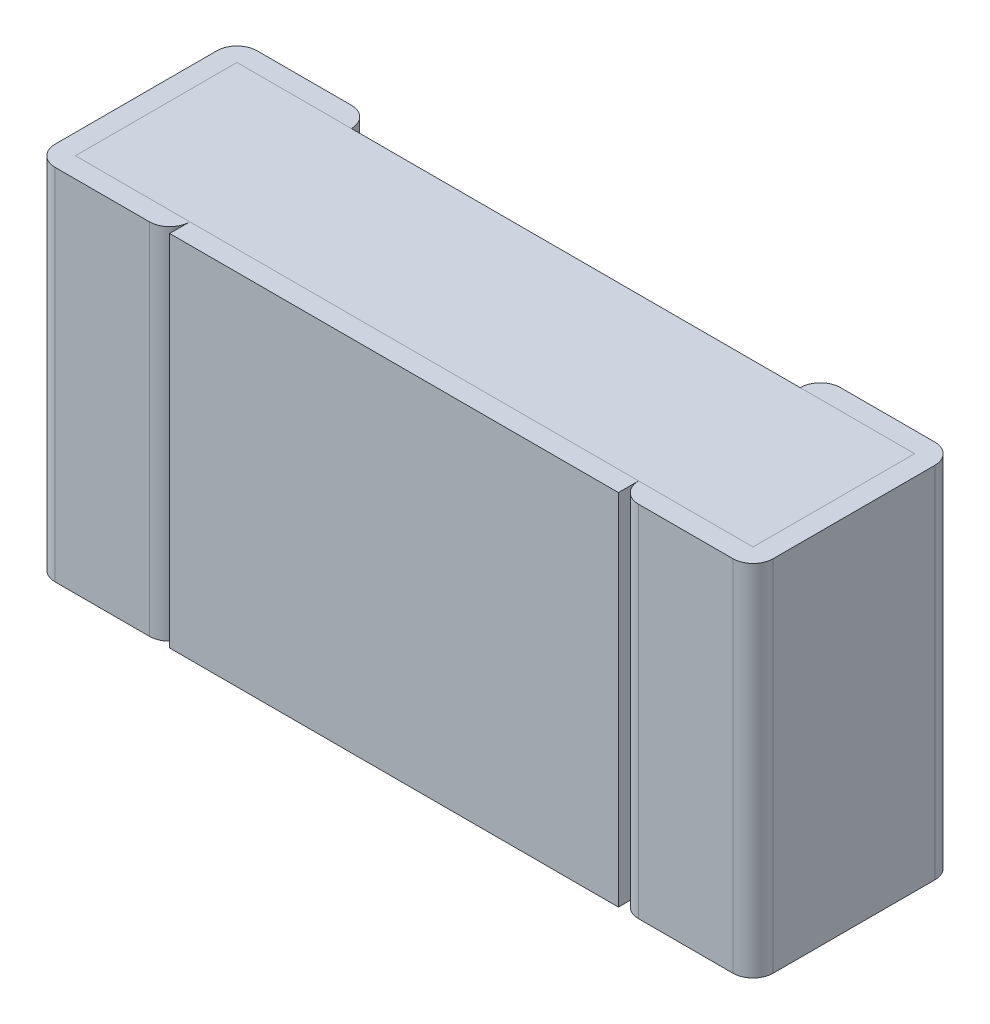
ISO-10303-21;
HEADER;
FILE_DESCRIPTION(('STEP AP214'),'2;1');
FILE_NAME('part.step','',(''),(''),'','','');
FILE_SCHEMA(('AUTOMOTIVE_DESIGN { 1 0 10303 214 1 1 1 1 }'));
ENDSEC;
DATA;
#1=APPLICATION_CONTEXT('core data for automotive mechanical design processes');
#2=APPLICATION_PROTOCOL_DEFINITION('international standard','automotive_design',2000,#1);
#3=PRODUCT_CONTEXT('',#1,'mechanical');
#4=PRODUCT('Part','Part','',(#3));
#5=PRODUCT_RELATED_PRODUCT_CATEGORY('part','',(#4));
#6=PRODUCT_DEFINITION_FORMATION('','',#4);
#7=PRODUCT_DEFINITION_CONTEXT('part definition',#1,'design');
#8=PRODUCT_DEFINITION('design','',#6,#7);
#9=PRODUCT_DEFINITION_SHAPE('','',#8);
#10=(LENGTH_UNIT() NAMED_UNIT(*) SI_UNIT(.MILLI.,.METRE.));
#11=(NAMED_UNIT(*) PLANE_ANGLE_UNIT() SI_UNIT($,.RADIAN.));
#12=(NAMED_UNIT(*) SI_UNIT($,.STERADIAN.) SOLID_ANGLE_UNIT());
#13=UNCERTAINTY_MEASURE_WITH_UNIT(LENGTH_MEASURE(1.E-05),#10,'distance_accuracy_value','');
#14=(GEOMETRIC_REPRESENTATION_CONTEXT(3) GLOBAL_UNCERTAINTY_ASSIGNED_CONTEXT((#13)) GLOBAL_UNIT_ASSIGNED_CONTEXT((#10,
#11,#12)) REPRESENTATION_CONTEXT('',''));
#15=CARTESIAN_POINT('',(0.,0.,0.));
#16=DIRECTION('',(0.,0.,1.));
#17=DIRECTION('',(1.,0.,0.));
#18=AXIS2_PLACEMENT_3D('',#15,#16,#17);
#19=CARTESIAN_POINT('',(194.804744279938,93.2580432923502,112.661582908599));
#20=DIRECTION('',(0.,0.,1.));
#21=DIRECTION('',(1.,0.,0.));
#22=AXIS2_PLACEMENT_3D('',#19,#20,#21);
#23=PLANE('',#22);
#24=DIRECTION('',(0.,1.,0.));
#25=VECTOR('',#24,1.);
#26=CARTESIAN_POINT('',(194.804744279938,93.2580432923502,112.661582908599));
#27=LINE('',#26,#25);
#28=CARTESIAN_POINT('',(194.804744279938,93.2580432923502,112.661582908599));
#29=VERTEX_POINT('',#28);
#30=CARTESIAN_POINT('',(194.804744279938,94.0580432923502,112.661582908599));
#31=VERTEX_POINT('',#30);
#32=EDGE_CURVE('E67',#29,#31,#27,.T.);
#33=ORIENTED_EDGE('',*,*,#32,.F.);
#34=DIRECTION('',(1.,0.,0.));
#35=VECTOR('',#34,1.);
#36=CARTESIAN_POINT('',(194.804744279938,93.2580432923502,112.661582908599));
#37=LINE('',#36,#35);
#38=CARTESIAN_POINT('',(195.804744279938,93.2580432923502,112.661582908599));
#39=VERTEX_POINT('',#38);
#40=EDGE_CURVE('E11',#29,#39,#37,.T.);
#41=ORIENTED_EDGE('',*,*,#40,.T.);
#42=DIRECTION('',(0.,1.,0.));
#43=VECTOR('',#42,1.);
#44=CARTESIAN_POINT('',(195.804744279938,93.2580432923502,112.661582908599));
#45=LINE('',#44,#43);
#46=CARTESIAN_POINT('',(195.804744279938,94.0580432923502,112.661582908599));
#47=VERTEX_POINT('',#46);
#48=EDGE_CURVE('E55',#39,#47,#45,.T.);
#49=ORIENTED_EDGE('',*,*,#48,.T.);
#50=DIRECTION('',(1.,0.,0.));
#51=VECTOR('',#50,1.);
#52=CARTESIAN_POINT('',(194.804744279938,94.0580432923502,112.661582908599));
#53=LINE('',#52,#51);
#54=EDGE_CURVE('E454',#31,#47,#53,.T.);
#55=ORIENTED_EDGE('',*,*,#54,.F.);
#56=EDGE_LOOP('',(#33,#41,#49,#55));
#57=FACE_BOUND('',#56,.T.);
#58=ADVANCED_FACE('F44',(#57),#23,.T.);
#59=CARTESIAN_POINT('',(195.804744279938,93.2580432923502,112.616582908599));
#60=DIRECTION('',(1.,0.,0.));
#61=DIRECTION('',(0.,1.,0.));
#62=AXIS2_PLACEMENT_3D('',#59,#60,#61);
#63=PLANE('',#62);
#64=DIRECTION('',(0.,0.,1.));
#65=VECTOR('',#64,1.);
#66=CARTESIAN_POINT('',(195.804744279938,93.2580432923502,112.616582908599));
#67=LINE('',#66,#65);
#68=CARTESIAN_POINT('',(195.804744279938,93.2580432923502,112.616582908599));
#69=VERTEX_POINT('',#68);
#70=EDGE_CURVE('E331',#69,#39,#67,.T.);
#71=ORIENTED_EDGE('',*,*,#70,.F.);
#72=DIRECTION('',(0.,1.,0.));
#73=VECTOR('',#72,1.);
#74=CARTESIAN_POINT('',(195.804744279938,93.2580432923502,112.616582908599));
#75=LINE('',#74,#73);
#76=CARTESIAN_POINT('',(195.804744279938,94.0580432923502,112.616582908599));
#77=VERTEX_POINT('',#76);
#78=EDGE_CURVE('E388',#69,#77,#75,.T.);
#79=ORIENTED_EDGE('',*,*,#78,.T.);
#80=DIRECTION('',(0.,0.,1.));
#81=VECTOR('',#80,1.);
#82=CARTESIAN_POINT('',(195.804744279938,94.0580432923502,112.616582908599));
#83=LINE('',#82,#81);
#84=EDGE_CURVE('E434',#77,#47,#83,.T.);
#85=ORIENTED_EDGE('',*,*,#84,.T.);
#86=ORIENTED_EDGE('',*,*,#48,.F.);
#87=EDGE_LOOP('',(#71,#79,#85,#86));
#88=FACE_BOUND('',#87,.T.);
#89=ADVANCED_FACE('F46',(#88),#63,.T.);
#90=CARTESIAN_POINT('',(195.849744279938,93.2580432923502,112.616582908599));
#91=DIRECTION('',(0.,1.,0.));
#92=DIRECTION('',(-1.,0.,0.));
#93=AXIS2_PLACEMENT_3D('',#90,#91,#92);
#94=CYLINDRICAL_SURFACE('',#93,0.0449999999999895);
#95=CARTESIAN_POINT('',(195.849744279938,93.2580432923502,112.616582908599));
#96=DIRECTION('',(0.,1.,0.));
#97=DIRECTION('',(0.,0.,1.));
#98=AXIS2_PLACEMENT_3D('',#95,#96,#97);
#99=CIRCLE('',#98,0.0450000000000034);
#100=CARTESIAN_POINT('',(195.849744279938,93.2580432923502,112.661582908599));
#101=VERTEX_POINT('',#100);
#102=EDGE_CURVE('E380',#69,#101,#99,.T.);
#103=ORIENTED_EDGE('',*,*,#102,.T.);
#104=DIRECTION('',(0.,1.,0.));
#105=VECTOR('',#104,1.);
#106=CARTESIAN_POINT('',(195.849744279938,93.2580432923502,112.661582908599));
#107=LINE('',#106,#105);
#108=CARTESIAN_POINT('',(195.849744279938,94.0580432923502,112.661582908599));
#109=VERTEX_POINT('',#108);
#110=EDGE_CURVE('E376',#101,#109,#107,.T.);
#111=ORIENTED_EDGE('',*,*,#110,.T.);
#112=CARTESIAN_POINT('',(195.849744279938,94.0580432923502,112.616582908599));
#113=DIRECTION('',(0.,1.,0.));
#114=DIRECTION('',(0.,0.,1.));
#115=AXIS2_PLACEMENT_3D('',#112,#113,#114);
#116=CIRCLE('',#115,0.0450000000000034);
#117=EDGE_CURVE('E297',#77,#109,#116,.T.);
#118=ORIENTED_EDGE('',*,*,#117,.F.);
#119=ORIENTED_EDGE('',*,*,#78,.F.);
#120=EDGE_LOOP('',(#103,#111,#118,#119));
#121=FACE_BOUND('',#120,.T.);
#122=ADVANCED_FACE('F537',(#121),#94,.T.);
#123=CARTESIAN_POINT('',(195.804744279938,93.2580432923502,112.661582908599));
#124=DIRECTION('',(0.,0.,1.));
#125=DIRECTION('',(1.,0.,0.));
#126=AXIS2_PLACEMENT_3D('',#123,#124,#125);
#127=PLANE('',#126);
#128=DIRECTION('',(1.,0.,0.));
#129=VECTOR('',#128,1.);
#130=CARTESIAN_POINT('',(195.804744279938,94.0580432923502,112.661582908599));
#131=LINE('',#130,#129);
#132=CARTESIAN_POINT('',(196.059744279938,94.0580432923502,112.661582908599));
#133=VERTEX_POINT('',#132);
#134=EDGE_CURVE('E372',#109,#133,#131,.T.);
#135=ORIENTED_EDGE('',*,*,#134,.F.);
#136=ORIENTED_EDGE('',*,*,#110,.F.);
#137=DIRECTION('',(1.,0.,0.));
#138=VECTOR('',#137,1.);
#139=CARTESIAN_POINT('',(195.804744279938,93.2580432923502,112.661582908599));
#140=LINE('',#139,#138);
#141=CARTESIAN_POINT('',(196.059744279938,93.2580432923502,112.661582908599));
#142=VERTEX_POINT('',#141);
#143=EDGE_CURVE('E381',#101,#142,#140,.T.);
#144=ORIENTED_EDGE('',*,*,#143,.T.);
#145=DIRECTION('',(0.,1.,0.));
#146=VECTOR('',#145,1.);
#147=CARTESIAN_POINT('',(196.059744279938,93.2580432923502,112.661582908599));
#148=LINE('',#147,#146);
#149=EDGE_CURVE('E423',#142,#133,#148,.T.);
#150=ORIENTED_EDGE('',*,*,#149,.T.);
#151=EDGE_LOOP('',(#135,#136,#144,#150));
#152=FACE_BOUND('',#151,.T.);
#153=ADVANCED_FACE('F533',(#152),#127,.T.);
#154=CARTESIAN_POINT('',(196.059744279938,93.2580432923502,112.616582908599));
#155=DIRECTION('',(0.,1.,0.));
#156=DIRECTION('',(1.,0.,0.));
#157=AXIS2_PLACEMENT_3D('',#154,#155,#156);
#158=CYLINDRICAL_SURFACE('',#157,0.0449999999999895);
#159=DIRECTION('',(0.,1.,0.));
#160=VECTOR('',#159,1.);
#161=CARTESIAN_POINT('',(196.104744279938,93.2580432923502,112.616582908599));
#162=LINE('',#161,#160);
#163=CARTESIAN_POINT('',(196.104744279938,93.2580432923502,112.616582908599));
#164=VERTEX_POINT('',#163);
#165=CARTESIAN_POINT('',(196.104744279938,94.0580432923502,112.616582908599));
#166=VERTEX_POINT('',#165);
#167=EDGE_CURVE('E419',#164,#166,#162,.T.);
#168=ORIENTED_EDGE('',*,*,#167,.T.);
#169=CARTESIAN_POINT('',(196.059744279938,94.0580432923502,112.616582908599));
#170=DIRECTION('',(0.,-1.,0.));
#171=DIRECTION('',(0.,0.,1.));
#172=AXIS2_PLACEMENT_3D('',#169,#170,#171);
#173=CIRCLE('',#172,0.0450000000000034);
#174=EDGE_CURVE('E424',#166,#133,#173,.T.);
#175=ORIENTED_EDGE('',*,*,#174,.T.);
#176=ORIENTED_EDGE('',*,*,#149,.F.);
#177=CARTESIAN_POINT('',(196.059744279938,93.2580432923502,112.616582908599));
#178=DIRECTION('',(0.,-1.,0.));
#179=DIRECTION('',(0.,0.,1.));
#180=AXIS2_PLACEMENT_3D('',#177,#178,#179);
#181=CIRCLE('',#180,0.0450000000000034);
#182=EDGE_CURVE('E363',#164,#142,#181,.T.);
#183=ORIENTED_EDGE('',*,*,#182,.F.);
#184=EDGE_LOOP('',(#168,#175,#176,#183));
#185=FACE_BOUND('',#184,.T.);
#186=ADVANCED_FACE('F511',(#185),#158,.T.);
#187=CARTESIAN_POINT('',(196.104744279938,93.2580432923502,112.211582908599));
#188=DIRECTION('',(1.,0.,0.));
#189=DIRECTION('',(0.,1.,0.));
#190=AXIS2_PLACEMENT_3D('',#187,#188,#189);
#191=PLANE('',#190);
#192=DIRECTION('',(0.,0.,1.));
#193=VECTOR('',#192,1.);
#194=CARTESIAN_POINT('',(196.104744279938,93.2580432923502,112.211582908599));
#195=LINE('',#194,#193);
#196=CARTESIAN_POINT('',(196.104744279938,93.2580432923502,112.256582908599));
#197=VERTEX_POINT('',#196);
#198=EDGE_CURVE('E332',#197,#164,#195,.T.);
#199=ORIENTED_EDGE('',*,*,#198,.F.);
#200=DIRECTION('',(0.,1.,0.));
#201=VECTOR('',#200,1.);
#202=CARTESIAN_POINT('',(196.104744279938,93.2580432923502,112.256582908599));
#203=LINE('',#202,#201);
#204=CARTESIAN_POINT('',(196.104744279938,94.0580432923502,112.256582908599));
#205=VERTEX_POINT('',#204);
#206=EDGE_CURVE('E428',#197,#205,#203,.T.);
#207=ORIENTED_EDGE('',*,*,#206,.T.);
#208=DIRECTION('',(0.,0.,1.));
#209=VECTOR('',#208,1.);
#210=CARTESIAN_POINT('',(196.104744279938,94.0580432923502,112.211582908599));
#211=LINE('',#210,#209);
#212=EDGE_CURVE('E291',#205,#166,#211,.T.);
#213=ORIENTED_EDGE('',*,*,#212,.T.);
#214=ORIENTED_EDGE('',*,*,#167,.F.);
#215=EDGE_LOOP('',(#199,#207,#213,#214));
#216=FACE_BOUND('',#215,.T.);
#217=ADVANCED_FACE('F505',(#216),#191,.T.);
#218=CARTESIAN_POINT('',(196.059744279938,93.2580432923502,112.256582908599));
#219=DIRECTION('',(0.,1.,0.));
#220=DIRECTION('',(1.,0.,0.));
#221=AXIS2_PLACEMENT_3D('',#218,#219,#220);
#222=CYLINDRICAL_SURFACE('',#221,0.0449999999999895);
#223=CARTESIAN_POINT('',(196.059744279938,93.2580432923502,112.256582908599));
#224=DIRECTION('',(0.,1.,0.));
#225=DIRECTION('',(0.,0.,1.));
#226=AXIS2_PLACEMENT_3D('',#223,#224,#225);
#227=CIRCLE('',#226,0.0450000000000034);
#228=CARTESIAN_POINT('',(196.059744279938,93.2580432923502,112.211582908599));
#229=VERTEX_POINT('',#228);
#230=EDGE_CURVE('E317',#197,#229,#227,.T.);
#231=ORIENTED_EDGE('',*,*,#230,.T.);
#232=DIRECTION('',(0.,1.,0.));
#233=VECTOR('',#232,1.);
#234=CARTESIAN_POINT('',(196.059744279938,93.2580432923502,112.211582908599));
#235=LINE('',#234,#233);
#236=CARTESIAN_POINT('',(196.059744279938,94.0580432923502,112.211582908599));
#237=VERTEX_POINT('',#236);
#238=EDGE_CURVE('E313',#229,#237,#235,.T.);
#239=ORIENTED_EDGE('',*,*,#238,.T.);
#240=CARTESIAN_POINT('',(196.059744279938,94.0580432923502,112.256582908599));
#241=DIRECTION('',(0.,1.,0.));
#242=DIRECTION('',(0.,0.,1.));
#243=AXIS2_PLACEMENT_3D('',#240,#241,#242);
#244=CIRCLE('',#243,0.0450000000000034);
#245=EDGE_CURVE('E352',#205,#237,#244,.T.);
#246=ORIENTED_EDGE('',*,*,#245,.F.);
#247=ORIENTED_EDGE('',*,*,#206,.F.);
#248=EDGE_LOOP('',(#231,#239,#246,#247));
#249=FACE_BOUND('',#248,.T.);
#250=ADVANCED_FACE('F606',(#249),#222,.T.);
#251=CARTESIAN_POINT('',(195.804744279938,93.2580432923502,112.211582908599));
#252=DIRECTION('',(0.,0.,1.));
#253=DIRECTION('',(1.,0.,0.));
#254=AXIS2_PLACEMENT_3D('',#251,#252,#253);
#255=PLANE('',#254);
#256=ORIENTED_EDGE('',*,*,#238,.F.);
#257=DIRECTION('',(1.,0.,0.));
#258=VECTOR('',#257,1.);
#259=CARTESIAN_POINT('',(195.804744279938,93.2580432923502,112.211582908599));
#260=LINE('',#259,#258);
#261=CARTESIAN_POINT('',(195.849744279938,93.2580432923502,112.211582908599));
#262=VERTEX_POINT('',#261);
#263=EDGE_CURVE('E301',#262,#229,#260,.T.);
#264=ORIENTED_EDGE('',*,*,#263,.F.);
#265=DIRECTION('',(0.,1.,0.));
#266=VECTOR('',#265,1.);
#267=CARTESIAN_POINT('',(195.849744279938,93.2580432923502,112.211582908599));
#268=LINE('',#267,#266);
#269=CARTESIAN_POINT('',(195.849744279938,94.0580432923502,112.211582908599));
#270=VERTEX_POINT('',#269);
#271=EDGE_CURVE('E318',#262,#270,#268,.T.);
#272=ORIENTED_EDGE('',*,*,#271,.T.);
#273=DIRECTION('',(1.,0.,0.));
#274=VECTOR('',#273,1.);
#275=CARTESIAN_POINT('',(195.804744279938,94.0580432923502,112.211582908599));
#276=LINE('',#275,#274);
#277=EDGE_CURVE('E364',#270,#237,#276,.T.);
#278=ORIENTED_EDGE('',*,*,#277,.T.);
#279=EDGE_LOOP('',(#256,#264,#272,#278));
#280=FACE_BOUND('',#279,.T.);
#281=ADVANCED_FACE('F602',(#280),#255,.F.);
#282=CARTESIAN_POINT('',(195.849744279938,93.2580432923502,112.256582908599));
#283=DIRECTION('',(0.,1.,0.));
#284=DIRECTION('',(-1.,0.,0.));
#285=AXIS2_PLACEMENT_3D('',#282,#283,#284);
#286=CYLINDRICAL_SURFACE('',#285,0.0449999999999895);
#287=DIRECTION('',(0.,1.,0.));
#288=VECTOR('',#287,1.);
#289=CARTESIAN_POINT('',(195.804744279938,93.2580432923502,112.256582908599));
#290=LINE('',#289,#288);
#291=CARTESIAN_POINT('',(195.804744279938,93.2580432923502,112.256582908599));
#292=VERTEX_POINT('',#291);
#293=CARTESIAN_POINT('',(195.804744279938,94.0580432923502,112.256582908599));
#294=VERTEX_POINT('',#293);
#295=EDGE_CURVE('E368',#292,#294,#290,.T.);
#296=ORIENTED_EDGE('',*,*,#295,.T.);
#297=CARTESIAN_POINT('',(195.849744279938,94.0580432923502,112.256582908599));
#298=DIRECTION('',(0.,-1.,0.));
#299=DIRECTION('',(0.,0.,1.));
#300=AXIS2_PLACEMENT_3D('',#297,#298,#299);
#301=CIRCLE('',#300,0.0450000000000034);
#302=EDGE_CURVE('E392',#294,#270,#301,.T.);
#303=ORIENTED_EDGE('',*,*,#302,.T.);
#304=ORIENTED_EDGE('',*,*,#271,.F.);
#305=CARTESIAN_POINT('',(195.849744279938,93.2580432923502,112.256582908599));
#306=DIRECTION('',(0.,-1.,0.));
#307=DIRECTION('',(0.,0.,1.));
#308=AXIS2_PLACEMENT_3D('',#305,#306,#307);
#309=CIRCLE('',#308,0.0450000000000034);
#310=EDGE_CURVE('E298',#292,#262,#309,.T.);
#311=ORIENTED_EDGE('',*,*,#310,.F.);
#312=EDGE_LOOP('',(#296,#303,#304,#311));
#313=FACE_BOUND('',#312,.T.);
#314=ADVANCED_FACE('F605',(#313),#286,.T.);
#315=CARTESIAN_POINT('',(194.804744279938,94.0580432923502,112.616582908599));
#316=DIRECTION('',(0.,1.,0.));
#317=DIRECTION('',(1.,0.,0.));
#318=AXIS2_PLACEMENT_3D('',#315,#316,#317);
#319=PLANE('',#318);
#320=DIRECTION('',(1.,0.,0.));
#321=VECTOR('',#320,1.);
#322=CARTESIAN_POINT('',(194.804744279938,94.0580432923502,112.616582908599));
#323=LINE('',#322,#321);
#324=CARTESIAN_POINT('',(194.804744279938,94.0580432923502,112.616582908599));
#325=VERTEX_POINT('',#324);
#326=EDGE_CURVE('E323',#325,#77,#323,.T.);
#327=ORIENTED_EDGE('',*,*,#326,.F.);
#328=DIRECTION('',(0.,0.,1.));
#329=VECTOR('',#328,1.);
#330=CARTESIAN_POINT('',(194.804744279938,94.0580432923502,112.616582908599));
#331=LINE('',#330,#329);
#332=EDGE_CURVE('E398',#325,#31,#331,.T.);
#333=ORIENTED_EDGE('',*,*,#332,.T.);
#334=ORIENTED_EDGE('',*,*,#54,.T.);
#335=ORIENTED_EDGE('',*,*,#84,.F.);
#336=EDGE_LOOP('',(#327,#333,#334,#335));
#337=FACE_BOUND('',#336,.T.);
#338=ADVANCED_FACE('F552',(#337),#319,.T.);
#339=CARTESIAN_POINT('',(195.804744279938,94.0580432923502,112.211582908599));
#340=DIRECTION('',(0.,1.,0.));
#341=DIRECTION('',(1.,0.,0.));
#342=AXIS2_PLACEMENT_3D('',#339,#340,#341);
#343=PLANE('',#342);
#344=ORIENTED_EDGE('',*,*,#277,.F.);
#345=ORIENTED_EDGE('',*,*,#302,.F.);
#346=DIRECTION('',(1.,0.,0.));
#347=VECTOR('',#346,1.);
#348=CARTESIAN_POINT('',(194.549744279938,94.0580432923502,112.256582908599));
#349=LINE('',#348,#347);
#350=CARTESIAN_POINT('',(196.059744279938,94.0580432923502,112.256582908599));
#351=VERTEX_POINT('',#350);
#352=EDGE_CURVE('E296',#294,#351,#349,.T.);
#353=ORIENTED_EDGE('',*,*,#352,.T.);
#354=DIRECTION('',(0.,0.,1.));
#355=VECTOR('',#354,1.);
#356=CARTESIAN_POINT('',(196.059744279938,94.0580432923502,112.256582908599));
#357=LINE('',#356,#355);
#358=CARTESIAN_POINT('',(196.059744279938,94.0580432923502,112.616582908599));
#359=VERTEX_POINT('',#358);
#360=EDGE_CURVE('E293',#351,#359,#357,.T.);
#361=ORIENTED_EDGE('',*,*,#360,.T.);
#362=DIRECTION('',(1.,0.,0.));
#363=VECTOR('',#362,1.);
#364=CARTESIAN_POINT('',(194.549744279938,94.0580432923502,112.616582908599));
#365=LINE('',#364,#363);
#366=EDGE_CURVE('E327',#77,#359,#365,.T.);
#367=ORIENTED_EDGE('',*,*,#366,.F.);
#368=ORIENTED_EDGE('',*,*,#117,.T.);
#369=ORIENTED_EDGE('',*,*,#134,.T.);
#370=ORIENTED_EDGE('',*,*,#174,.F.);
#371=ORIENTED_EDGE('',*,*,#212,.F.);
#372=ORIENTED_EDGE('',*,*,#245,.T.);
#373=EDGE_LOOP('',(#344,#345,#353,#361,#367,#368,#369,#370,#371,#372));
#374=FACE_BOUND('',#373,.T.);
#375=ADVANCED_FACE('F507',(#374),#343,.T.);
#376=CARTESIAN_POINT('',(194.804744279938,93.2580432923502,112.616582908599));
#377=DIRECTION('',(1.,0.,0.));
#378=DIRECTION('',(0.,1.,0.));
#379=AXIS2_PLACEMENT_3D('',#376,#377,#378);
#380=PLANE('',#379);
#381=ORIENTED_EDGE('',*,*,#32,.T.);
#382=ORIENTED_EDGE('',*,*,#332,.F.);
#383=DIRECTION('',(0.,1.,0.));
#384=VECTOR('',#383,1.);
#385=CARTESIAN_POINT('',(194.804744279938,93.2580432923502,112.616582908599));
#386=LINE('',#385,#384);
#387=CARTESIAN_POINT('',(194.804744279938,93.2580432923502,112.616582908599));
#388=VERTEX_POINT('',#387);
#389=EDGE_CURVE('E205',#388,#325,#386,.T.);
#390=ORIENTED_EDGE('',*,*,#389,.F.);
#391=DIRECTION('',(0.,0.,1.));
#392=VECTOR('',#391,1.);
#393=CARTESIAN_POINT('',(194.804744279938,93.2580432923502,112.616582908599));
#394=LINE('',#393,#392);
#395=EDGE_CURVE('E353',#388,#29,#394,.T.);
#396=ORIENTED_EDGE('',*,*,#395,.T.);
#397=EDGE_LOOP('',(#381,#382,#390,#396));
#398=FACE_BOUND('',#397,.T.);
#399=ADVANCED_FACE('F562',(#398),#380,.F.);
#400=CARTESIAN_POINT('',(194.804744279938,93.2580432923502,112.616582908599));
#401=DIRECTION('',(0.,1.,0.));
#402=DIRECTION('',(1.,0.,0.));
#403=AXIS2_PLACEMENT_3D('',#400,#401,#402);
#404=PLANE('',#403);
#405=ORIENTED_EDGE('',*,*,#70,.T.);
#406=ORIENTED_EDGE('',*,*,#40,.F.);
#407=ORIENTED_EDGE('',*,*,#395,.F.);
#408=DIRECTION('',(1.,0.,0.));
#409=VECTOR('',#408,1.);
#410=CARTESIAN_POINT('',(194.804744279938,93.2580432923502,112.616582908599));
#411=LINE('',#410,#409);
#412=EDGE_CURVE('E328',#388,#69,#411,.T.);
#413=ORIENTED_EDGE('',*,*,#412,.T.);
#414=EDGE_LOOP('',(#405,#406,#407,#413));
#415=FACE_BOUND('',#414,.T.);
#416=ADVANCED_FACE('F556',(#415),#404,.F.);
#417=CARTESIAN_POINT('',(195.804744279938,93.2580432923502,112.211582908599));
#418=DIRECTION('',(0.,1.,0.));
#419=DIRECTION('',(1.,0.,0.));
#420=AXIS2_PLACEMENT_3D('',#417,#418,#419);
#421=PLANE('',#420);
#422=ORIENTED_EDGE('',*,*,#230,.F.);
#423=ORIENTED_EDGE('',*,*,#198,.T.);
#424=ORIENTED_EDGE('',*,*,#182,.T.);
#425=ORIENTED_EDGE('',*,*,#143,.F.);
#426=ORIENTED_EDGE('',*,*,#102,.F.);
#427=DIRECTION('',(1.,0.,0.));
#428=VECTOR('',#427,1.);
#429=CARTESIAN_POINT('',(194.549744279938,93.2580432923502,112.616582908599));
#430=LINE('',#429,#428);
#431=CARTESIAN_POINT('',(196.059744279938,93.2580432923502,112.616582908599));
#432=VERTEX_POINT('',#431);
#433=EDGE_CURVE('E48',#69,#432,#430,.T.);
#434=ORIENTED_EDGE('',*,*,#433,.T.);
#435=DIRECTION('',(0.,0.,1.));
#436=VECTOR('',#435,1.);
#437=CARTESIAN_POINT('',(196.059744279938,93.2580432923502,112.256582908599));
#438=LINE('',#437,#436);
#439=CARTESIAN_POINT('',(196.059744279938,93.2580432923502,112.256582908599));
#440=VERTEX_POINT('',#439);
#441=EDGE_CURVE('E412',#440,#432,#438,.T.);
#442=ORIENTED_EDGE('',*,*,#441,.F.);
#443=DIRECTION('',(1.,0.,0.));
#444=VECTOR('',#443,1.);
#445=CARTESIAN_POINT('',(194.549744279938,93.2580432923502,112.256582908599));
#446=LINE('',#445,#444);
#447=EDGE_CURVE('E216',#292,#440,#446,.T.);
#448=ORIENTED_EDGE('',*,*,#447,.F.);
#449=ORIENTED_EDGE('',*,*,#310,.T.);
#450=ORIENTED_EDGE('',*,*,#263,.T.);
#451=EDGE_LOOP('',(#422,#423,#424,#425,#426,#434,#442,#448,#449,#450));
#452=FACE_BOUND('',#451,.T.);
#453=ADVANCED_FACE('F514',(#452),#421,.F.);
#454=CARTESIAN_POINT('',(194.549744279938,93.2580432923502,112.256582908599));
#455=DIRECTION('',(0.,0.,1.));
#456=DIRECTION('',(1.,0.,0.));
#457=AXIS2_PLACEMENT_3D('',#454,#455,#456);
#458=PLANE('',#457);
#459=DIRECTION('',(1.,0.,0.));
#460=VECTOR('',#459,1.);
#461=CARTESIAN_POINT('',(194.549744279938,94.0580432923502,112.256582908599));
#462=LINE('',#461,#460);
#463=CARTESIAN_POINT('',(194.804744279938,94.0580432923502,112.256582908599));
#464=VERTEX_POINT('',#463);
#465=EDGE_CURVE('E308',#464,#294,#462,.T.);
#466=ORIENTED_EDGE('',*,*,#465,.T.);
#467=ORIENTED_EDGE('',*,*,#295,.F.);
#468=DIRECTION('',(1.,0.,0.));
#469=VECTOR('',#468,1.);
#470=CARTESIAN_POINT('',(194.549744279938,93.2580432923502,112.256582908599));
#471=LINE('',#470,#469);
#472=CARTESIAN_POINT('',(194.804744279938,93.2580432923502,112.256582908599));
#473=VERTEX_POINT('',#472);
#474=EDGE_CURVE('E340',#473,#292,#471,.T.);
#475=ORIENTED_EDGE('',*,*,#474,.F.);
#476=DIRECTION('',(0.,1.,0.));
#477=VECTOR('',#476,1.);
#478=CARTESIAN_POINT('',(194.804744279938,93.2580432923502,112.256582908599));
#479=LINE('',#478,#477);
#480=EDGE_CURVE('E305',#473,#464,#479,.T.);
#481=ORIENTED_EDGE('',*,*,#480,.T.);
#482=EDGE_LOOP('',(#466,#467,#475,#481));
#483=FACE_BOUND('',#482,.T.);
#484=ADVANCED_FACE('F595',(#483),#458,.F.);
#485=CARTESIAN_POINT('',(194.549744279938,94.0580432923502,112.256582908599));
#486=DIRECTION('',(0.,1.,0.));
#487=DIRECTION('',(1.,0.,0.));
#488=AXIS2_PLACEMENT_3D('',#485,#486,#487);
#489=PLANE('',#488);
#490=DIRECTION('',(1.,0.,0.));
#491=VECTOR('',#490,1.);
#492=CARTESIAN_POINT('',(194.549744279938,94.0580432923502,112.256582908599));
#493=LINE('',#492,#491);
#494=CARTESIAN_POINT('',(194.549744279938,94.0580432923502,112.256582908599));
#495=VERTEX_POINT('',#494);
#496=EDGE_CURVE('E96',#495,#464,#493,.T.);
#497=ORIENTED_EDGE('',*,*,#496,.F.);
#498=DIRECTION('',(0.,0.,1.));
#499=VECTOR('',#498,1.);
#500=CARTESIAN_POINT('',(194.549744279938,94.0580432923502,112.256582908599));
#501=LINE('',#500,#499);
#502=CARTESIAN_POINT('',(194.549744279938,94.0580432923502,112.616582908599));
#503=VERTEX_POINT('',#502);
#504=EDGE_CURVE('E309',#495,#503,#501,.T.);
#505=ORIENTED_EDGE('',*,*,#504,.T.);
#506=DIRECTION('',(1.,0.,0.));
#507=VECTOR('',#506,1.);
#508=CARTESIAN_POINT('',(194.549744279938,94.0580432923502,112.616582908599));
#509=LINE('',#508,#507);
#510=EDGE_CURVE('E326',#503,#325,#509,.T.);
#511=ORIENTED_EDGE('',*,*,#510,.T.);
#512=ORIENTED_EDGE('',*,*,#326,.T.);
#513=ORIENTED_EDGE('',*,*,#366,.T.);
#514=ORIENTED_EDGE('',*,*,#360,.F.);
#515=ORIENTED_EDGE('',*,*,#352,.F.);
#516=ORIENTED_EDGE('',*,*,#465,.F.);
#517=EDGE_LOOP('',(#497,#505,#511,#512,#513,#514,#515,#516));
#518=FACE_BOUND('',#517,.T.);
#519=ADVANCED_FACE('F549',(#518),#489,.T.);
#520=CARTESIAN_POINT('',(194.759744279938,93.2580432923502,112.616582908599));
#521=DIRECTION('',(0.,1.,0.));
#522=DIRECTION('',(1.,0.,0.));
#523=AXIS2_PLACEMENT_3D('',#520,#521,#522);
#524=CYLINDRICAL_SURFACE('',#523,0.0449999999999895);
#525=ORIENTED_EDGE('',*,*,#389,.T.);
#526=CARTESIAN_POINT('',(194.759744279938,94.0580432923502,112.616582908599));
#527=DIRECTION('',(0.,-1.,0.));
#528=DIRECTION('',(0.,0.,1.));
#529=AXIS2_PLACEMENT_3D('',#526,#527,#528);
#530=CIRCLE('',#529,0.0450000000000034);
#531=CARTESIAN_POINT('',(194.759744279938,94.0580432923502,112.661582908599));
#532=VERTEX_POINT('',#531);
#533=EDGE_CURVE('E357',#325,#532,#530,.T.);
#534=ORIENTED_EDGE('',*,*,#533,.T.);
#535=DIRECTION('',(0.,1.,0.));
#536=VECTOR('',#535,1.);
#537=CARTESIAN_POINT('',(194.759744279938,93.2580432923502,112.661582908599));
#538=LINE('',#537,#536);
#539=CARTESIAN_POINT('',(194.759744279938,93.2580432923502,112.661582908599));
#540=VERTEX_POINT('',#539);
#541=EDGE_CURVE('E335',#540,#532,#538,.T.);
#542=ORIENTED_EDGE('',*,*,#541,.F.);
#543=CARTESIAN_POINT('',(194.759744279938,93.2580432923502,112.616582908599));
#544=DIRECTION('',(0.,-1.,0.));
#545=DIRECTION('',(0.,0.,1.));
#546=AXIS2_PLACEMENT_3D('',#543,#544,#545);
#547=CIRCLE('',#546,0.0450000000000034);
#548=EDGE_CURVE('E344',#388,#540,#547,.T.);
#549=ORIENTED_EDGE('',*,*,#548,.F.);
#550=EDGE_LOOP('',(#525,#534,#542,#549));
#551=FACE_BOUND('',#550,.T.);
#552=ADVANCED_FACE('F559',(#551),#524,.T.);
#553=CARTESIAN_POINT('',(194.504744279938,93.2580432923502,112.661582908599));
#554=DIRECTION('',(0.,0.,1.));
#555=DIRECTION('',(1.,0.,0.));
#556=AXIS2_PLACEMENT_3D('',#553,#554,#555);
#557=PLANE('',#556);
#558=DIRECTION('',(1.,0.,0.));
#559=VECTOR('',#558,1.);
#560=CARTESIAN_POINT('',(194.504744279938,94.0580432923502,112.661582908599));
#561=LINE('',#560,#559);
#562=CARTESIAN_POINT('',(194.549744279938,94.0580432923502,112.661582908599));
#563=VERTEX_POINT('',#562);
#564=EDGE_CURVE('E319',#563,#532,#561,.T.);
#565=ORIENTED_EDGE('',*,*,#564,.F.);
#566=DIRECTION('',(0.,1.,0.));
#567=VECTOR('',#566,1.);
#568=CARTESIAN_POINT('',(194.549744279938,93.2580432923502,112.661582908599));
#569=LINE('',#568,#567);
#570=CARTESIAN_POINT('',(194.549744279938,93.2580432923502,112.661582908599));
#571=VERTEX_POINT('',#570);
#572=EDGE_CURVE('E283',#571,#563,#569,.T.);
#573=ORIENTED_EDGE('',*,*,#572,.F.);
#574=DIRECTION('',(1.,0.,0.));
#575=VECTOR('',#574,1.);
#576=CARTESIAN_POINT('',(194.504744279938,93.2580432923502,112.661582908599));
#577=LINE('',#576,#575);
#578=EDGE_CURVE('E339',#571,#540,#577,.T.);
#579=ORIENTED_EDGE('',*,*,#578,.T.);
#580=ORIENTED_EDGE('',*,*,#541,.T.);
#581=EDGE_LOOP('',(#565,#573,#579,#580));
#582=FACE_BOUND('',#581,.T.);
#583=ADVANCED_FACE('F568',(#582),#557,.T.);
#584=CARTESIAN_POINT('',(194.549744279938,93.2580432923502,112.256582908599));
#585=DIRECTION('',(0.,1.,0.));
#586=DIRECTION('',(1.,0.,0.));
#587=AXIS2_PLACEMENT_3D('',#584,#585,#586);
#588=PLANE('',#587);
#589=ORIENTED_EDGE('',*,*,#474,.T.);
#590=ORIENTED_EDGE('',*,*,#447,.T.);
#591=ORIENTED_EDGE('',*,*,#441,.T.);
#592=ORIENTED_EDGE('',*,*,#433,.F.);
#593=ORIENTED_EDGE('',*,*,#412,.F.);
#594=DIRECTION('',(1.,0.,0.));
#595=VECTOR('',#594,1.);
#596=CARTESIAN_POINT('',(194.549744279938,93.2580432923502,112.616582908599));
#597=LINE('',#596,#595);
#598=CARTESIAN_POINT('',(194.549744279938,93.2580432923502,112.616582908599));
#599=VERTEX_POINT('',#598);
#600=EDGE_CURVE('E287',#599,#388,#597,.T.);
#601=ORIENTED_EDGE('',*,*,#600,.F.);
#602=DIRECTION('',(0.,0.,1.));
#603=VECTOR('',#602,1.);
#604=CARTESIAN_POINT('',(194.549744279938,93.2580432923502,112.256582908599));
#605=LINE('',#604,#603);
#606=CARTESIAN_POINT('',(194.549744279938,93.2580432923502,112.256582908599));
#607=VERTEX_POINT('',#606);
#608=EDGE_CURVE('E277',#607,#599,#605,.T.);
#609=ORIENTED_EDGE('',*,*,#608,.F.);
#610=DIRECTION('',(1.,0.,0.));
#611=VECTOR('',#610,1.);
#612=CARTESIAN_POINT('',(194.549744279938,93.2580432923502,112.256582908599));
#613=LINE('',#612,#611);
#614=EDGE_CURVE('E349',#607,#473,#613,.T.);
#615=ORIENTED_EDGE('',*,*,#614,.T.);
#616=EDGE_LOOP('',(#589,#590,#591,#592,#593,#601,#609,#615));
#617=FACE_BOUND('',#616,.T.);
#618=ADVANCED_FACE('F542',(#617),#588,.F.);
#619=CARTESIAN_POINT('',(194.759744279938,93.2580432923502,112.256582908599));
#620=DIRECTION('',(0.,1.,0.));
#621=DIRECTION('',(1.,0.,0.));
#622=AXIS2_PLACEMENT_3D('',#619,#620,#621);
#623=CYLINDRICAL_SURFACE('',#622,0.0449999999999895);
#624=CARTESIAN_POINT('',(194.759744279938,93.2580432923502,112.256582908599));
#625=DIRECTION('',(0.,1.,0.));
#626=DIRECTION('',(0.,0.,1.));
#627=AXIS2_PLACEMENT_3D('',#624,#625,#626);
#628=CIRCLE('',#627,0.0450000000000034);
#629=CARTESIAN_POINT('',(194.759744279938,93.2580432923502,112.211582908599));
#630=VERTEX_POINT('',#629);
#631=EDGE_CURVE('E345',#473,#630,#628,.T.);
#632=ORIENTED_EDGE('',*,*,#631,.T.);
#633=DIRECTION('',(0.,1.,0.));
#634=VECTOR('',#633,1.);
#635=CARTESIAN_POINT('',(194.759744279938,93.2580432923502,112.211582908599));
#636=LINE('',#635,#634);
#637=CARTESIAN_POINT('',(194.759744279938,94.0580432923502,112.211582908599));
#638=VERTEX_POINT('',#637);
#639=EDGE_CURVE('E270',#630,#638,#636,.T.);
#640=ORIENTED_EDGE('',*,*,#639,.T.);
#641=CARTESIAN_POINT('',(194.759744279938,94.0580432923502,112.256582908599));
#642=DIRECTION('',(0.,1.,0.));
#643=DIRECTION('',(0.,0.,1.));
#644=AXIS2_PLACEMENT_3D('',#641,#642,#643);
#645=CIRCLE('',#644,0.0450000000000034);
#646=EDGE_CURVE('E260',#464,#638,#645,.T.);
#647=ORIENTED_EDGE('',*,*,#646,.F.);
#648=ORIENTED_EDGE('',*,*,#480,.F.);
#649=EDGE_LOOP('',(#632,#640,#647,#648));
#650=FACE_BOUND('',#649,.T.);
#651=ADVANCED_FACE('F614',(#650),#623,.T.);
#652=CARTESIAN_POINT('',(194.504744279938,93.2580432923502,112.211582908599));
#653=DIRECTION('',(0.,0.,1.));
#654=DIRECTION('',(1.,0.,0.));
#655=AXIS2_PLACEMENT_3D('',#652,#653,#654);
#656=PLANE('',#655);
#657=ORIENTED_EDGE('',*,*,#639,.F.);
#658=DIRECTION('',(1.,0.,0.));
#659=VECTOR('',#658,1.);
#660=CARTESIAN_POINT('',(194.504744279938,93.2580432923502,112.211582908599));
#661=LINE('',#660,#659);
#662=CARTESIAN_POINT('',(194.549744279938,93.2580432923502,112.211582908599));
#663=VERTEX_POINT('',#662);
#664=EDGE_CURVE('E249',#663,#630,#661,.T.);
#665=ORIENTED_EDGE('',*,*,#664,.F.);
#666=DIRECTION('',(0.,1.,0.));
#667=VECTOR('',#666,1.);
#668=CARTESIAN_POINT('',(194.549744279938,93.2580432923502,112.211582908599));
#669=LINE('',#668,#667);
#670=CARTESIAN_POINT('',(194.549744279938,94.0580432923502,112.211582908599));
#671=VERTEX_POINT('',#670);
#672=EDGE_CURVE('E263',#663,#671,#669,.T.);
#673=ORIENTED_EDGE('',*,*,#672,.T.);
#674=DIRECTION('',(1.,0.,0.));
#675=VECTOR('',#674,1.);
#676=CARTESIAN_POINT('',(194.504744279938,94.0580432923502,112.211582908599));
#677=LINE('',#676,#675);
#678=EDGE_CURVE('E254',#671,#638,#677,.T.);
#679=ORIENTED_EDGE('',*,*,#678,.T.);
#680=EDGE_LOOP('',(#657,#665,#673,#679));
#681=FACE_BOUND('',#680,.T.);
#682=ADVANCED_FACE('F266',(#681),#656,.F.);
#683=CARTESIAN_POINT('',(194.504744279938,94.0580432923502,112.211582908599));
#684=DIRECTION('',(0.,1.,0.));
#685=DIRECTION('',(1.,0.,0.));
#686=AXIS2_PLACEMENT_3D('',#683,#684,#685);
#687=PLANE('',#686);
#688=ORIENTED_EDGE('',*,*,#678,.F.);
#689=CARTESIAN_POINT('',(194.549744279938,94.0580432923502,112.256582908599));
#690=DIRECTION('',(0.,-1.,0.));
#691=DIRECTION('',(0.,0.,1.));
#692=AXIS2_PLACEMENT_3D('',#689,#690,#691);
#693=CIRCLE('',#692,0.0450000000000034);
#694=CARTESIAN_POINT('',(194.504744279938,94.0580432923502,112.256582908599));
#695=VERTEX_POINT('',#694);
#696=EDGE_CURVE('E257',#695,#671,#693,.T.);
#697=ORIENTED_EDGE('',*,*,#696,.F.);
#698=DIRECTION('',(0.,0.,1.));
#699=VECTOR('',#698,1.);
#700=CARTESIAN_POINT('',(194.504744279938,94.0580432923502,112.211582908599));
#701=LINE('',#700,#699);
#702=CARTESIAN_POINT('',(194.504744279938,94.0580432923502,112.616582908599));
#703=VERTEX_POINT('',#702);
#704=EDGE_CURVE('E264',#695,#703,#701,.T.);
#705=ORIENTED_EDGE('',*,*,#704,.T.);
#706=CARTESIAN_POINT('',(194.549744279938,94.0580432923502,112.616582908599));
#707=DIRECTION('',(0.,1.,0.));
#708=DIRECTION('',(0.,0.,1.));
#709=AXIS2_PLACEMENT_3D('',#706,#707,#708);
#710=CIRCLE('',#709,0.0450000000000034);
#711=EDGE_CURVE('E165',#703,#563,#710,.T.);
#712=ORIENTED_EDGE('',*,*,#711,.T.);
#713=ORIENTED_EDGE('',*,*,#564,.T.);
#714=ORIENTED_EDGE('',*,*,#533,.F.);
#715=ORIENTED_EDGE('',*,*,#510,.F.);
#716=ORIENTED_EDGE('',*,*,#504,.F.);
#717=ORIENTED_EDGE('',*,*,#496,.T.);
#718=ORIENTED_EDGE('',*,*,#646,.T.);
#719=EDGE_LOOP('',(#688,#697,#705,#712,#713,#714,#715,#716,#717,#718));
#720=FACE_BOUND('',#719,.T.);
#721=ADVANCED_FACE('F255',(#720),#687,.T.);
#722=CARTESIAN_POINT('',(194.549744279938,93.2580432923502,112.616582908599));
#723=DIRECTION('',(0.,1.,0.));
#724=DIRECTION('',(-1.,0.,0.));
#725=AXIS2_PLACEMENT_3D('',#722,#723,#724);
#726=CYLINDRICAL_SURFACE('',#725,0.0449999999999895);
#727=CARTESIAN_POINT('',(194.549744279938,93.2580432923502,112.616582908599));
#728=DIRECTION('',(0.,1.,0.));
#729=DIRECTION('',(0.,0.,1.));
#730=AXIS2_PLACEMENT_3D('',#727,#728,#729);
#731=CIRCLE('',#730,0.0450000000000034);
#732=CARTESIAN_POINT('',(194.504744279938,93.2580432923502,112.616582908599));
#733=VERTEX_POINT('',#732);
#734=EDGE_CURVE('E312',#733,#571,#731,.T.);
#735=ORIENTED_EDGE('',*,*,#734,.T.);
#736=ORIENTED_EDGE('',*,*,#572,.T.);
#737=ORIENTED_EDGE('',*,*,#711,.F.);
#738=DIRECTION('',(0.,1.,0.));
#739=VECTOR('',#738,1.);
#740=CARTESIAN_POINT('',(194.504744279938,93.2580432923502,112.616582908599));
#741=LINE('',#740,#739);
#742=EDGE_CURVE('E156',#733,#703,#741,.T.);
#743=ORIENTED_EDGE('',*,*,#742,.F.);
#744=EDGE_LOOP('',(#735,#736,#737,#743));
#745=FACE_BOUND('',#744,.T.);
#746=ADVANCED_FACE('F571',(#745),#726,.T.);
#747=CARTESIAN_POINT('',(194.549744279938,93.2580432923502,112.256582908599));
#748=DIRECTION('',(0.,1.,0.));
#749=DIRECTION('',(-1.,0.,0.));
#750=AXIS2_PLACEMENT_3D('',#747,#748,#749);
#751=CYLINDRICAL_SURFACE('',#750,0.0449999999999895);
#752=DIRECTION('',(0.,1.,0.));
#753=VECTOR('',#752,1.);
#754=CARTESIAN_POINT('',(194.504744279938,93.2580432923502,112.256582908599));
#755=LINE('',#754,#753);
#756=CARTESIAN_POINT('',(194.504744279938,93.2580432923502,112.256582908599));
#757=VERTEX_POINT('',#756);
#758=EDGE_CURVE('E275',#757,#695,#755,.T.);
#759=ORIENTED_EDGE('',*,*,#758,.T.);
#760=ORIENTED_EDGE('',*,*,#696,.T.);
#761=ORIENTED_EDGE('',*,*,#672,.F.);
#762=CARTESIAN_POINT('',(194.549744279938,93.2580432923502,112.256582908599));
#763=DIRECTION('',(0.,-1.,0.));
#764=DIRECTION('',(0.,0.,1.));
#765=AXIS2_PLACEMENT_3D('',#762,#763,#764);
#766=CIRCLE('',#765,0.0450000000000034);
#767=EDGE_CURVE('E304',#757,#663,#766,.T.);
#768=ORIENTED_EDGE('',*,*,#767,.F.);
#769=EDGE_LOOP('',(#759,#760,#761,#768));
#770=FACE_BOUND('',#769,.T.);
#771=ADVANCED_FACE('F273',(#770),#751,.T.);
#772=CARTESIAN_POINT('',(194.504744279938,93.2580432923502,112.211582908599));
#773=DIRECTION('',(0.,1.,0.));
#774=DIRECTION('',(1.,0.,0.));
#775=AXIS2_PLACEMENT_3D('',#772,#773,#774);
#776=PLANE('',#775);
#777=ORIENTED_EDGE('',*,*,#631,.F.);
#778=ORIENTED_EDGE('',*,*,#614,.F.);
#779=ORIENTED_EDGE('',*,*,#608,.T.);
#780=ORIENTED_EDGE('',*,*,#600,.T.);
#781=ORIENTED_EDGE('',*,*,#548,.T.);
#782=ORIENTED_EDGE('',*,*,#578,.F.);
#783=ORIENTED_EDGE('',*,*,#734,.F.);
#784=DIRECTION('',(0.,0.,1.));
#785=VECTOR('',#784,1.);
#786=CARTESIAN_POINT('',(194.504744279938,93.2580432923502,112.211582908599));
#787=LINE('',#786,#785);
#788=EDGE_CURVE('E448',#757,#733,#787,.T.);
#789=ORIENTED_EDGE('',*,*,#788,.F.);
#790=ORIENTED_EDGE('',*,*,#767,.T.);
#791=ORIENTED_EDGE('',*,*,#664,.T.);
#792=EDGE_LOOP('',(#777,#778,#779,#780,#781,#782,#783,#789,#790,#791));
#793=FACE_BOUND('',#792,.T.);
#794=ADVANCED_FACE('F570',(#793),#776,.F.);
#795=CARTESIAN_POINT('',(194.504744279938,93.2580432923502,112.211582908599));
#796=DIRECTION('',(1.,0.,0.));
#797=DIRECTION('',(0.,1.,0.));
#798=AXIS2_PLACEMENT_3D('',#795,#796,#797);
#799=PLANE('',#798);
#800=ORIENTED_EDGE('',*,*,#742,.T.);
#801=ORIENTED_EDGE('',*,*,#704,.F.);
#802=ORIENTED_EDGE('',*,*,#758,.F.);
#803=ORIENTED_EDGE('',*,*,#788,.T.);
#804=EDGE_LOOP('',(#800,#801,#802,#803));
#805=FACE_BOUND('',#804,.T.);
#806=ADVANCED_FACE('F598',(#805),#799,.F.);
#807=CLOSED_SHELL('',(#58,#89,#122,#153,#186,#217,#250,#281,#314,#338,#375,#399,#416,#453,#484,
#519,#552,#583,#618,#651,#682,#721,#746,#771,#794,#806));
#808=MANIFOLD_SOLID_BREP('B2',#807);
#809=ADVANCED_BREP_SHAPE_REPRESENTATION('',(#18,#808),#14);
#810=SHAPE_DEFINITION_REPRESENTATION(#9,#809);
ENDSEC;
END-ISO-10303-21;
